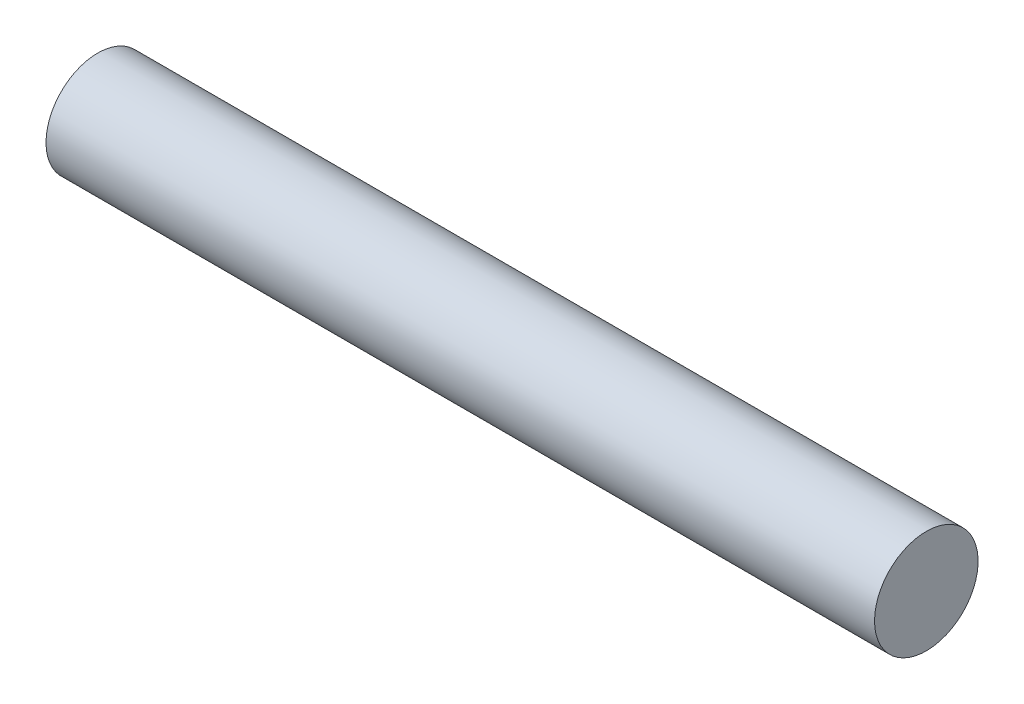
ISO-10303-21;
HEADER;
FILE_DESCRIPTION(('STEP AP214'),'2;1');
FILE_NAME('part.step','',(''),(''),'','','');
FILE_SCHEMA(('AUTOMOTIVE_DESIGN { 1 0 10303 214 1 1 1 1 }'));
ENDSEC;
DATA;
#1=APPLICATION_CONTEXT('core data for automotive mechanical design processes');
#2=APPLICATION_PROTOCOL_DEFINITION('international standard','automotive_design',2000,#1);
#3=PRODUCT_CONTEXT('',#1,'mechanical');
#4=PRODUCT('Part','Part','',(#3));
#5=PRODUCT_RELATED_PRODUCT_CATEGORY('part','',(#4));
#6=PRODUCT_DEFINITION_FORMATION('','',#4);
#7=PRODUCT_DEFINITION_CONTEXT('part definition',#1,'design');
#8=PRODUCT_DEFINITION('design','',#6,#7);
#9=PRODUCT_DEFINITION_SHAPE('','',#8);
#10=(LENGTH_UNIT() NAMED_UNIT(*) SI_UNIT(.MILLI.,.METRE.));
#11=(NAMED_UNIT(*) PLANE_ANGLE_UNIT() SI_UNIT($,.RADIAN.));
#12=(NAMED_UNIT(*) SI_UNIT($,.STERADIAN.) SOLID_ANGLE_UNIT());
#13=UNCERTAINTY_MEASURE_WITH_UNIT(LENGTH_MEASURE(1.E-05),#10,'distance_accuracy_value','');
#14=(GEOMETRIC_REPRESENTATION_CONTEXT(3) GLOBAL_UNCERTAINTY_ASSIGNED_CONTEXT((#13)) GLOBAL_UNIT_ASSIGNED_CONTEXT((#10,
#11,#12)) REPRESENTATION_CONTEXT('',''));
#15=CARTESIAN_POINT('',(0.,0.,0.));
#16=DIRECTION('',(0.,0.,1.));
#17=DIRECTION('',(1.,0.,0.));
#18=AXIS2_PLACEMENT_3D('',#15,#16,#17);
#19=CARTESIAN_POINT('',(-20.,0.,0.));
#20=DIRECTION('',(1.,0.,0.));
#21=DIRECTION('',(0.,0.,-1.));
#22=AXIS2_PLACEMENT_3D('',#19,#20,#21);
#23=PLANE('',#22);
#24=CARTESIAN_POINT('',(-20.,0.,0.));
#25=DIRECTION('',(-1.,0.,0.));
#26=DIRECTION('',(0.,0.,1.));
#27=AXIS2_PLACEMENT_3D('',#24,#25,#26);
#28=CIRCLE('',#27,2.5);
#29=CARTESIAN_POINT('',(-20.,0.,2.5));
#30=VERTEX_POINT('',#29);
#31=EDGE_CURVE('E9',#30,#30,#28,.T.);
#32=ORIENTED_EDGE('',*,*,#31,.T.);
#33=EDGE_LOOP('',(#32));
#34=FACE_BOUND('',#33,.T.);
#35=ADVANCED_FACE('F14',(#34),#23,.F.);
#36=CARTESIAN_POINT('',(-36.7202712449729,0.,0.));
#37=DIRECTION('',(-1.,0.,0.));
#38=DIRECTION('',(0.,0.,1.));
#39=AXIS2_PLACEMENT_3D('',#36,#37,#38);
#40=CYLINDRICAL_SURFACE('',#39,2.5);
#41=ORIENTED_EDGE('',*,*,#31,.F.);
#42=EDGE_LOOP('',(#41));
#43=FACE_BOUND('',#42,.T.);
#44=CARTESIAN_POINT('',(20.,0.,0.));
#45=DIRECTION('',(-1.,0.,0.));
#46=DIRECTION('',(0.,0.,1.));
#47=AXIS2_PLACEMENT_3D('',#44,#45,#46);
#48=CIRCLE('',#47,2.5);
#49=CARTESIAN_POINT('',(20.,0.,2.5));
#50=VERTEX_POINT('',#49);
#51=EDGE_CURVE('E20',#50,#50,#48,.T.);
#52=ORIENTED_EDGE('',*,*,#51,.T.);
#53=EDGE_LOOP('',(#52));
#54=FACE_BOUND('',#53,.T.);
#55=ADVANCED_FACE('F26',(#43,#54),#40,.T.);
#56=CARTESIAN_POINT('',(20.,2.5,0.));
#57=DIRECTION('',(-1.,0.,0.));
#58=DIRECTION('',(0.,0.,1.));
#59=AXIS2_PLACEMENT_3D('',#56,#57,#58);
#60=PLANE('',#59);
#61=ORIENTED_EDGE('',*,*,#51,.F.);
#62=EDGE_LOOP('',(#61));
#63=FACE_BOUND('',#62,.T.);
#64=ADVANCED_FACE('F28',(#63),#60,.F.);
#65=CLOSED_SHELL('',(#35,#55,#64));
#66=MANIFOLD_SOLID_BREP('B1',#65);
#67=ADVANCED_BREP_SHAPE_REPRESENTATION('',(#18,#66),#14);
#68=SHAPE_DEFINITION_REPRESENTATION(#9,#67);
ENDSEC;
END-ISO-10303-21;
